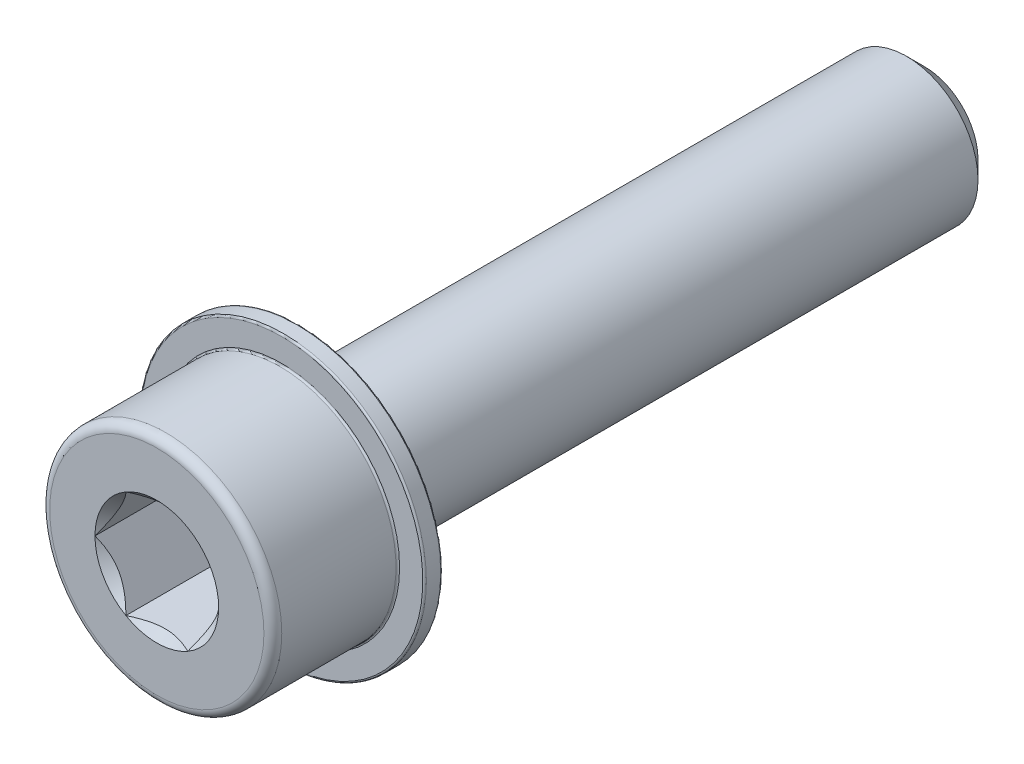
ISO-10303-21;
HEADER;
FILE_DESCRIPTION(('STEP AP214'),'2;1');
FILE_NAME('part.step','',(''),(''),'','','');
FILE_SCHEMA(('AUTOMOTIVE_DESIGN { 1 0 10303 214 1 1 1 1 }'));
ENDSEC;
DATA;
#1=APPLICATION_CONTEXT('core data for automotive mechanical design processes');
#2=APPLICATION_PROTOCOL_DEFINITION('international standard','automotive_design',2000,#1);
#3=PRODUCT_CONTEXT('',#1,'mechanical');
#4=PRODUCT('Part','Part','',(#3));
#5=PRODUCT_RELATED_PRODUCT_CATEGORY('part','',(#4));
#6=PRODUCT_DEFINITION_FORMATION('','',#4);
#7=PRODUCT_DEFINITION_CONTEXT('part definition',#1,'design');
#8=PRODUCT_DEFINITION('design','',#6,#7);
#9=PRODUCT_DEFINITION_SHAPE('','',#8);
#10=(LENGTH_UNIT() NAMED_UNIT(*) SI_UNIT(.MILLI.,.METRE.));
#11=(NAMED_UNIT(*) PLANE_ANGLE_UNIT() SI_UNIT($,.RADIAN.));
#12=(NAMED_UNIT(*) SI_UNIT($,.STERADIAN.) SOLID_ANGLE_UNIT());
#13=UNCERTAINTY_MEASURE_WITH_UNIT(LENGTH_MEASURE(1.E-05),#10,'distance_accuracy_value','');
#14=(GEOMETRIC_REPRESENTATION_CONTEXT(3) GLOBAL_UNCERTAINTY_ASSIGNED_CONTEXT((#13)) GLOBAL_UNIT_ASSIGNED_CONTEXT((#10,
#11,#12)) REPRESENTATION_CONTEXT('',''));
#15=CARTESIAN_POINT('',(0.,0.,0.));
#16=DIRECTION('',(0.,0.,1.));
#17=DIRECTION('',(1.,0.,0.));
#18=AXIS2_PLACEMENT_3D('',#15,#16,#17);
#19=CARTESIAN_POINT('',(0.,0.,43.));
#20=DIRECTION('',(0.,0.,-1.));
#21=DIRECTION('',(-1.,0.,0.));
#22=AXIS2_PLACEMENT_3D('',#19,#20,#21);
#23=CYLINDRICAL_SURFACE('',#22,6.5);
#24=CARTESIAN_POINT('',(0.,0.,36.1));
#25=DIRECTION('',(0.,0.,-1.));
#26=DIRECTION('',(-1.,0.,0.));
#27=AXIS2_PLACEMENT_3D('',#24,#25,#26);
#28=CIRCLE('',#27,6.5);
#29=CARTESIAN_POINT('',(-6.5,0.,36.1));
#30=VERTEX_POINT('',#29);
#31=EDGE_CURVE('E11',#30,#30,#28,.F.);
#32=ORIENTED_EDGE('',*,*,#31,.T.);
#33=EDGE_LOOP('',(#32));
#34=FACE_BOUND('',#33,.T.);
#35=CARTESIAN_POINT('',(0.,0.,42.5));
#36=DIRECTION('',(0.,0.,1.));
#37=DIRECTION('',(1.,0.,0.));
#38=AXIS2_PLACEMENT_3D('',#35,#36,#37);
#39=CIRCLE('',#38,6.5);
#40=CARTESIAN_POINT('',(6.5,0.,42.5));
#41=VERTEX_POINT('',#40);
#42=EDGE_CURVE('E275',#41,#41,#39,.F.);
#43=ORIENTED_EDGE('',*,*,#42,.T.);
#44=EDGE_LOOP('',(#43));
#45=FACE_BOUND('',#44,.T.);
#46=ADVANCED_FACE('F41',(#34,#45),#23,.T.);
#47=CARTESIAN_POINT('',(0.,0.,43.));
#48=DIRECTION('',(0.,0.,1.));
#49=DIRECTION('',(1.,0.,0.));
#50=AXIS2_PLACEMENT_3D('',#47,#48,#49);
#51=PLANE('',#50);
#52=CARTESIAN_POINT('',(0.,0.,43.));
#53=DIRECTION('',(0.,0.,1.));
#54=DIRECTION('',(1.,0.,0.));
#55=AXIS2_PLACEMENT_3D('',#52,#53,#54);
#56=CIRCLE('',#55,6.);
#57=CARTESIAN_POINT('',(6.,0.,43.));
#58=VERTEX_POINT('',#57);
#59=EDGE_CURVE('E117',#58,#58,#56,.T.);
#60=ORIENTED_EDGE('',*,*,#59,.T.);
#61=EDGE_LOOP('',(#60));
#62=FACE_BOUND('',#61,.T.);
#63=CARTESIAN_POINT('',(0.,0.,43.));
#64=DIRECTION('',(0.,0.,1.));
#65=DIRECTION('',(1.,0.,0.));
#66=AXIS2_PLACEMENT_3D('',#63,#64,#65);
#67=CIRCLE('',#66,3.46410161513776);
#68=CARTESIAN_POINT('',(3.46410161513776,0.,43.));
#69=VERTEX_POINT('',#68);
#70=CARTESIAN_POINT('',(1.73205080756888,3.,43.));
#71=VERTEX_POINT('',#70);
#72=EDGE_CURVE('E96',#69,#71,#67,.T.);
#73=ORIENTED_EDGE('',*,*,#72,.F.);
#74=CARTESIAN_POINT('',(1.73205080756888,-3.,43.));
#75=VERTEX_POINT('',#74);
#76=EDGE_CURVE('E56',#75,#69,#67,.T.);
#77=ORIENTED_EDGE('',*,*,#76,.F.);
#78=CARTESIAN_POINT('',(-1.73205080756888,-3.,43.));
#79=VERTEX_POINT('',#78);
#80=EDGE_CURVE('E360',#79,#75,#67,.T.);
#81=ORIENTED_EDGE('',*,*,#80,.F.);
#82=CARTESIAN_POINT('',(-3.46410161513776,0.,43.));
#83=VERTEX_POINT('',#82);
#84=EDGE_CURVE('E63',#83,#79,#67,.T.);
#85=ORIENTED_EDGE('',*,*,#84,.F.);
#86=CARTESIAN_POINT('',(-1.73205080756888,3.,43.));
#87=VERTEX_POINT('',#86);
#88=EDGE_CURVE('E141',#87,#83,#67,.T.);
#89=ORIENTED_EDGE('',*,*,#88,.F.);
#90=EDGE_CURVE('E106',#71,#87,#67,.T.);
#91=ORIENTED_EDGE('',*,*,#90,.F.);
#92=EDGE_LOOP('',(#73,#77,#81,#85,#89,#91));
#93=FACE_BOUND('',#92,.T.);
#94=ADVANCED_FACE('F140',(#62,#93),#51,.T.);
#95=CARTESIAN_POINT('',(0.,0.,43.));
#96=DIRECTION('',(0.,0.,1.));
#97=DIRECTION('',(1.,0.,0.));
#98=AXIS2_PLACEMENT_3D('',#95,#96,#97);
#99=CONICAL_SURFACE('',#98,3.46410161513776,0.785398163397449);
#100=ORIENTED_EDGE('',*,*,#90,.T.);
#101=CARTESIAN_POINT('',(-3.40188153141397,3.,44.071623018675));
#102=CARTESIAN_POINT('',(-3.31880839496224,3.,44.0093307707653));
#103=CARTESIAN_POINT('',(-3.23526432463499,3.,43.9476562262713));
#104=CARTESIAN_POINT('',(-3.06705083944725,3.,43.825817186681));
#105=CARTESIAN_POINT('',(-2.98238114192822,3.,43.7656530822642));
#106=CARTESIAN_POINT('',(-2.81111390830011,3.,43.6466823260063));
#107=CARTESIAN_POINT('',(-2.72450651479473,3.,43.5878898159252));
#108=CARTESIAN_POINT('',(-2.54981284655259,3.,43.4725516902232));
#109=CARTESIAN_POINT('',(-2.46172667795769,3.,43.4160059143113));
#110=CARTESIAN_POINT('',(-2.27892768432208,3.,43.3026064434241));
#111=CARTESIAN_POINT('',(-2.18411772294209,3.,43.2459085325007));
#112=CARTESIAN_POINT('',(-1.99231796342786,3.,43.1363338489189));
#113=CARTESIAN_POINT('',(-1.89532845598628,3.,43.0834565706102));
#114=CARTESIAN_POINT('',(-1.69915024178689,3.,42.9826433846406));
#115=CARTESIAN_POINT('',(-1.59996871640864,3.,42.9346936118117));
#116=CARTESIAN_POINT('',(-1.39893527870467,3.,42.8448170133997));
#117=CARTESIAN_POINT('',(-1.29708458210817,3.,42.8028875002659));
#118=CARTESIAN_POINT('',(-1.0982186531427,3.,42.7293601977538));
#119=CARTESIAN_POINT('',(-1.00140329048654,3.,42.6972274830937));
#120=CARTESIAN_POINT('',(-0.805487586800682,3.,42.6407367466802));
#121=CARTESIAN_POINT('',(-0.706387084473372,3.,42.6163792755582));
#122=CARTESIAN_POINT('',(-0.508116211624924,3.,42.5771014895869));
#123=CARTESIAN_POINT('',(-0.408977763183683,3.,42.5620226377466));
#124=CARTESIAN_POINT('',(-0.209698791301063,3.,42.5415865192691));
#125=CARTESIAN_POINT('',(-0.109558431989065,3.,42.5362276857281));
#126=CARTESIAN_POINT('',(0.0873520516843396,3.,42.535609235846));
#127=CARTESIAN_POINT('',(0.184121252918255,3.,42.5400131533177));
#128=CARTESIAN_POINT('',(0.376804854524577,3.,42.557946416793));
#129=CARTESIAN_POINT('',(0.472719169351944,3.,42.5714766658715));
#130=CARTESIAN_POINT('',(0.66461966332242,3.,42.6071635369876));
#131=CARTESIAN_POINT('',(0.760578448954834,3.,42.6294651712297));
#132=CARTESIAN_POINT('',(0.950411386335509,3.,42.6815211461887));
#133=CARTESIAN_POINT('',(1.04428572934496,3.,42.7112748000321));
#134=CARTESIAN_POINT('',(1.23968230612517,3.,42.7805237867733));
#135=CARTESIAN_POINT('',(1.34095401081408,3.,42.8207192131534));
#136=CARTESIAN_POINT('',(1.54084264319093,3.,42.9072590407946));
#137=CARTESIAN_POINT('',(1.63945865301323,3.,42.9536055360041));
#138=CARTESIAN_POINT('',(1.8345457021536,3.,43.0513511324151));
#139=CARTESIAN_POINT('',(1.93100848905254,3.,43.1027665721575));
#140=CARTESIAN_POINT('',(2.12170828880386,3.,43.2095076183011));
#141=CARTESIAN_POINT('',(2.21594570238895,3.,43.2648325134343));
#142=CARTESIAN_POINT('',(2.39783630702514,3.,43.3757799204079));
#143=CARTESIAN_POINT('',(2.48558325753569,3.,43.4312495308021));
#144=CARTESIAN_POINT('',(2.65957133871347,3.,43.54450927189));
#145=CARTESIAN_POINT('',(2.74581235420107,3.,43.6022995789736));
#146=CARTESIAN_POINT('',(2.91628413803161,3.,43.7193054641893));
#147=CARTESIAN_POINT('',(3.00052556721127,3.,43.7785055655618));
#148=CARTESIAN_POINT('',(3.16785911169908,3.,43.8984622960702));
#149=CARTESIAN_POINT('',(3.25095153629611,3.,43.9592184932626));
#150=CARTESIAN_POINT('',(3.33356317170769,3.,44.0206105740407));
#151=B_SPLINE_CURVE_WITH_KNOTS('',3,(#101,#102,#103,#104,#105,#106,#107,#108,#109,#110,#111,
#112,#113,#114,#115,#116,#117,#118,#119,#120,#121,#122,#123,#124,#125,#126,#127,#128,#129,#130,
#131,#132,#133,#134,#135,#136,#137,#138,#139,#140,#141,#142,#143,#144,#145,#146,#147,#148,#149,
#150),.UNSPECIFIED.,.F.,.F.,(4,2,2,2,2,2,2,2,2,2,2,2,2,2,2,2,2,2,2,2,2,2,2,2,4),(0.,
0.311507889644127,0.623095538398646,0.937099065704866,1.25108015037407,1.58241857439007,
1.91371306604159,2.24404824101607,2.57423548692227,2.87999017792551,3.18576651722764,
3.486161620239,3.78650829411698,4.07666515932723,4.36685074054528,4.6620503227987,
4.95722270569223,5.28383771583299,5.61056419890146,5.93838056110907,6.266137434759,
6.57752286720456,6.8889320121875,7.19780024979462,7.50658366111557),.UNSPECIFIED.);
#152=EDGE_CURVE('E111',#71,#87,#151,.F.);
#153=ORIENTED_EDGE('',*,*,#152,.F.);
#154=EDGE_LOOP('',(#100,#153));
#155=FACE_BOUND('',#154,.T.);
#156=ADVANCED_FACE('F112',(#155),#99,.F.);
#157=ORIENTED_EDGE('',*,*,#88,.T.);
#158=CARTESIAN_POINT('',(-1.73193533751504,3.0002,43.0001154758272));
#159=CARTESIAN_POINT('',(-1.79147372663452,2.89707648504425,42.9406283183218));
#160=CARTESIAN_POINT('',(-1.85200767512883,2.79222861066935,42.8846349794655));
#161=CARTESIAN_POINT('',(-1.97544301635334,2.5784323282189,42.7821125963789));
#162=CARTESIAN_POINT('',(-2.03835614749388,2.46946358862024,42.7356405937413));
#163=CARTESIAN_POINT('',(-2.16521745390422,2.24973336040297,42.6560331885163));
#164=CARTESIAN_POINT('',(-2.22913332270057,2.13902782823778,42.6226977006427));
#165=CARTESIAN_POINT('',(-2.35837216363117,1.91517958943467,42.5713375439793));
#166=CARTESIAN_POINT('',(-2.42369118784644,1.802043720793,42.5532745375356));
#167=CARTESIAN_POINT('',(-2.53626564359199,1.60705904380729,42.5369769084505));
#168=CARTESIAN_POINT('',(-2.58337569224233,1.52546204599786,42.5345643671738));
#169=CARTESIAN_POINT('',(-2.67751916315866,1.36240077116991,42.5386294346571));
#170=CARTESIAN_POINT('',(-2.7245525527757,1.28093655070101,42.5451101600283));
#171=CARTESIAN_POINT('',(-2.81817374583238,1.11877988766163,42.5665917225152));
#172=CARTESIAN_POINT('',(-2.86476099147974,1.03808841121569,42.5816020899673));
#173=CARTESIAN_POINT('',(-2.95713536549225,0.878091302108662,42.619323646066));
#174=CARTESIAN_POINT('',(-3.00292255491614,0.798785563690701,42.6420342443228));
#175=CARTESIAN_POINT('',(-3.0842086834051,0.657993859197244,42.6887606848539));
#176=CARTESIAN_POINT('',(-3.11988753362891,0.596196277853972,42.7115483276808));
#177=CARTESIAN_POINT('',(-3.19060468282508,0.473710582479779,42.7607962860574));
#178=CARTESIAN_POINT('',(-3.2256429622163,0.413022502364396,42.7872567136662));
#179=CARTESIAN_POINT('',(-3.29496858432307,0.292947002609138,42.8432569943914));
#180=CARTESIAN_POINT('',(-3.3292578988429,0.233556167704084,42.8727871644784));
#181=CARTESIAN_POINT('',(-3.39720147685868,0.115874438532734,42.9345390915755));
#182=CARTESIAN_POINT('',(-3.43085611477446,0.0575828957522678,42.9667591966594));
#183=CARTESIAN_POINT('',(-3.46421708519159,-0.000199999999998803,43.0001154758271));
#184=B_SPLINE_CURVE_WITH_KNOTS('',3,(#158,#159,#160,#161,#162,#163,#164,#165,#166,#167,#168,
#169,#170,#171,#172,#173,#174,#175,#176,#177,#178,#179,#180,#181,#182,#183),.UNSPECIFIED.,.F.,
.F.,(4,2,2,2,2,2,2,2,2,2,2,2,4),(0.,0.399603557139307,0.801535286397852,1.19708369162344,
1.59163620080174,1.87398941755845,2.15644160919094,2.43921001247426,2.72195674032139,
2.94657516661927,3.17120044767275,3.3951375283781,3.61893808380739),.UNSPECIFIED.);
#185=EDGE_CURVE('E105',#87,#83,#184,.T.);
#186=ORIENTED_EDGE('',*,*,#185,.F.);
#187=EDGE_LOOP('',(#157,#186));
#188=FACE_BOUND('',#187,.T.);
#189=ADVANCED_FACE('F371',(#188),#99,.F.);
#190=ORIENTED_EDGE('',*,*,#84,.T.);
#191=CARTESIAN_POINT('',(-3.46421708519159,0.000199999999998564,43.0001154758271));
#192=CARTESIAN_POINT('',(-3.40467869607211,-0.102923514955748,42.9406283183218));
#193=CARTESIAN_POINT('',(-3.3441447475778,-0.20777138933065,42.8846349794655));
#194=CARTESIAN_POINT('',(-3.22070940635329,-0.421567671781096,42.7821125963789));
#195=CARTESIAN_POINT('',(-3.15779627521275,-0.530536411379761,42.7356405937413));
#196=CARTESIAN_POINT('',(-3.03093496880241,-0.750266639597031,42.6560331885163));
#197=CARTESIAN_POINT('',(-2.96701910000606,-0.860972171762214,42.6226977006427));
#198=CARTESIAN_POINT('',(-2.83778025907546,-1.08482041056533,42.5713375439793));
#199=CARTESIAN_POINT('',(-2.77246123486019,-1.197956279207,42.5532745375356));
#200=CARTESIAN_POINT('',(-2.65988677911464,-1.3929409561927,42.5369769084505));
#201=CARTESIAN_POINT('',(-2.6127767304643,-1.47453795400214,42.5345643671738));
#202=CARTESIAN_POINT('',(-2.51863325954798,-1.63759922883009,42.5386294346571));
#203=CARTESIAN_POINT('',(-2.47159986993094,-1.71906344929899,42.5451101600283));
#204=CARTESIAN_POINT('',(-2.37797867687426,-1.88122011233837,42.5665917225152));
#205=CARTESIAN_POINT('',(-2.33139143122689,-1.9619115887843,42.5816020899673));
#206=CARTESIAN_POINT('',(-2.23901705721438,-2.12190869789134,42.619323646066));
#207=CARTESIAN_POINT('',(-2.19322986779049,-2.2012144363093,42.6420342443228));
#208=CARTESIAN_POINT('',(-2.11194373930153,-2.34200614080275,42.6887606848539));
#209=CARTESIAN_POINT('',(-2.07626488907772,-2.40380372214602,42.7115483276808));
#210=CARTESIAN_POINT('',(-2.00554773988155,-2.52628941752022,42.7607962860574));
#211=CARTESIAN_POINT('',(-1.97050946049033,-2.5869774976356,42.7872567136662));
#212=CARTESIAN_POINT('',(-1.90118383838355,-2.70705299739086,42.8432569943914));
#213=CARTESIAN_POINT('',(-1.86689452386372,-2.76644383229592,42.8727871644784));
#214=CARTESIAN_POINT('',(-1.79895094584794,-2.88412556146727,42.9345390915755));
#215=CARTESIAN_POINT('',(-1.76529630793216,-2.94241710424774,42.9667591966594));
#216=CARTESIAN_POINT('',(-1.73193533751504,-3.0002,43.0001154758272));
#217=B_SPLINE_CURVE_WITH_KNOTS('',3,(#191,#192,#193,#194,#195,#196,#197,#198,#199,#200,#201,
#202,#203,#204,#205,#206,#207,#208,#209,#210,#211,#212,#213,#214,#215,#216),.UNSPECIFIED.,.F.,
.F.,(4,2,2,2,2,2,2,2,2,2,2,2,4),(0.,0.399603557139304,0.801535286397844,1.19708369162343,
1.59163620080173,1.87398941755844,2.15644160919093,2.43921001247425,2.72195674032138,
2.94657516661926,3.17120044767274,3.3951375283781,3.61893808380739),.UNSPECIFIED.);
#218=EDGE_CURVE('E154',#83,#79,#217,.T.);
#219=ORIENTED_EDGE('',*,*,#218,.F.);
#220=EDGE_LOOP('',(#190,#219));
#221=FACE_BOUND('',#220,.T.);
#222=ADVANCED_FACE('F373',(#221),#99,.F.);
#223=ORIENTED_EDGE('',*,*,#80,.T.);
#224=CARTESIAN_POINT('',(-3.40188153141397,-3.,44.071623018675));
#225=CARTESIAN_POINT('',(-3.31880839496224,-3.,44.0093307707653));
#226=CARTESIAN_POINT('',(-3.23526432463498,-3.,43.9476562262713));
#227=CARTESIAN_POINT('',(-3.06705083944725,-3.,43.825817186681));
#228=CARTESIAN_POINT('',(-2.98238114192822,-3.,43.7656530822642));
#229=CARTESIAN_POINT('',(-2.81111390830011,-3.,43.6466823260063));
#230=CARTESIAN_POINT('',(-2.72450651479473,-3.,43.5878898159252));
#231=CARTESIAN_POINT('',(-2.54981284655259,-3.,43.4725516902232));
#232=CARTESIAN_POINT('',(-2.46172667795768,-3.,43.4160059143113));
#233=CARTESIAN_POINT('',(-2.27892768432207,-3.,43.3026064434241));
#234=CARTESIAN_POINT('',(-2.18411772294209,-3.,43.2459085325007));
#235=CARTESIAN_POINT('',(-1.99231796342786,-3.,43.1363338489189));
#236=CARTESIAN_POINT('',(-1.89532845598629,-3.,43.0834565706102));
#237=CARTESIAN_POINT('',(-1.69915024178689,-3.,42.9826433846406));
#238=CARTESIAN_POINT('',(-1.59996871640864,-3.,42.9346936118117));
#239=CARTESIAN_POINT('',(-1.39893527870467,-3.,42.8448170133997));
#240=CARTESIAN_POINT('',(-1.29708458210817,-3.,42.8028875002659));
#241=CARTESIAN_POINT('',(-1.0982186531427,-3.,42.7293601977538));
#242=CARTESIAN_POINT('',(-1.00140329048654,-3.,42.6972274830937));
#243=CARTESIAN_POINT('',(-0.80548758680068,-3.,42.6407367466802));
#244=CARTESIAN_POINT('',(-0.70638708447337,-3.,42.6163792755582));
#245=CARTESIAN_POINT('',(-0.508116211624922,-3.,42.5771014895869));
#246=CARTESIAN_POINT('',(-0.408977763183681,-3.,42.5620226377466));
#247=CARTESIAN_POINT('',(-0.20969879130106,-3.,42.5415865192691));
#248=CARTESIAN_POINT('',(-0.109558431989063,-3.,42.5362276857281));
#249=CARTESIAN_POINT('',(0.0873520516843408,-3.,42.535609235846));
#250=CARTESIAN_POINT('',(0.184121252918256,-3.,42.5400131533177));
#251=CARTESIAN_POINT('',(0.376804854524577,-3.,42.557946416793));
#252=CARTESIAN_POINT('',(0.472719169351944,-3.,42.5714766658715));
#253=CARTESIAN_POINT('',(0.664619663322421,-3.,42.6071635369876));
#254=CARTESIAN_POINT('',(0.760578448954834,-3.,42.6294651712297));
#255=CARTESIAN_POINT('',(0.95041138633551,-3.,42.6815211461887));
#256=CARTESIAN_POINT('',(1.04428572934496,-3.,42.7112748000321));
#257=CARTESIAN_POINT('',(1.23968230612517,-3.,42.7805237867733));
#258=CARTESIAN_POINT('',(1.34095401081408,-3.,42.8207192131534));
#259=CARTESIAN_POINT('',(1.54084264319093,-3.,42.9072590407946));
#260=CARTESIAN_POINT('',(1.63945865301324,-3.,42.9536055360041));
#261=CARTESIAN_POINT('',(1.8345457021536,-3.,43.0513511324151));
#262=CARTESIAN_POINT('',(1.93100848905254,-3.,43.1027665721575));
#263=CARTESIAN_POINT('',(2.12170828880386,-3.,43.2095076183011));
#264=CARTESIAN_POINT('',(2.21594570238895,-3.,43.2648325134343));
#265=CARTESIAN_POINT('',(2.39783630702514,-3.,43.3757799204079));
#266=CARTESIAN_POINT('',(2.48558325753569,-3.,43.4312495308021));
#267=CARTESIAN_POINT('',(2.65957133871347,-3.,43.54450927189));
#268=CARTESIAN_POINT('',(2.74581235420107,-3.,43.6022995789736));
#269=CARTESIAN_POINT('',(2.91628413803161,-3.,43.7193054641893));
#270=CARTESIAN_POINT('',(3.00052556721127,-3.,43.7785055655619));
#271=CARTESIAN_POINT('',(3.16785911169908,-3.,43.8984622960703));
#272=CARTESIAN_POINT('',(3.25095153629612,-3.,43.9592184932626));
#273=CARTESIAN_POINT('',(3.3335631717077,-3.,44.0206105740407));
#274=B_SPLINE_CURVE_WITH_KNOTS('',3,(#224,#225,#226,#227,#228,#229,#230,#231,#232,#233,#234,
#235,#236,#237,#238,#239,#240,#241,#242,#243,#244,#245,#246,#247,#248,#249,#250,#251,#252,#253,
#254,#255,#256,#257,#258,#259,#260,#261,#262,#263,#264,#265,#266,#267,#268,#269,#270,#271,#272,
#273),.UNSPECIFIED.,.F.,.F.,(4,2,2,2,2,2,2,2,2,2,2,2,2,2,2,2,2,2,2,2,2,2,2,2,4),(0.,
0.311507889644125,0.623095538398644,0.937099065704865,1.25108015037407,1.58241857439006,
1.91371306604159,2.24404824101607,2.57423548692227,2.87999017792551,3.18576651722764,
3.486161620239,3.78650829411698,4.07666515932722,4.36685074054528,4.6620503227987,
4.95722270569223,5.28383771583299,5.61056419890146,5.93838056110907,6.266137434759,
6.57752286720456,6.8889320121875,7.19780024979462,7.50658366111557),.UNSPECIFIED.);
#275=EDGE_CURVE('E184',#79,#75,#274,.T.);
#276=ORIENTED_EDGE('',*,*,#275,.F.);
#277=EDGE_LOOP('',(#223,#276));
#278=FACE_BOUND('',#277,.T.);
#279=ADVANCED_FACE('F361',(#278),#99,.F.);
#280=ORIENTED_EDGE('',*,*,#76,.T.);
#281=CARTESIAN_POINT('',(1.73193533751504,-3.0002,43.0001154758272));
#282=CARTESIAN_POINT('',(1.79147372663452,-2.89707648504425,42.9406283183218));
#283=CARTESIAN_POINT('',(1.85200767512883,-2.79222861066935,42.8846349794655));
#284=CARTESIAN_POINT('',(1.97544301635334,-2.57843232821891,42.7821125963789));
#285=CARTESIAN_POINT('',(2.03835614749388,-2.46946358862024,42.7356405937413));
#286=CARTESIAN_POINT('',(2.16521745390422,-2.24973336040297,42.6560331885163));
#287=CARTESIAN_POINT('',(2.22913332270057,-2.13902782823779,42.6226977006427));
#288=CARTESIAN_POINT('',(2.35837216363117,-1.91517958943468,42.5713375439793));
#289=CARTESIAN_POINT('',(2.42369118784644,-1.80204372079301,42.5532745375356));
#290=CARTESIAN_POINT('',(2.53626564359199,-1.6070590438073,42.5369769084505));
#291=CARTESIAN_POINT('',(2.58337569224233,-1.52546204599787,42.5345643671738));
#292=CARTESIAN_POINT('',(2.67751916315865,-1.36240077116991,42.5386294346571));
#293=CARTESIAN_POINT('',(2.7245525527757,-1.28093655070101,42.5451101600283));
#294=CARTESIAN_POINT('',(2.81817374583237,-1.11877988766163,42.5665917225152));
#295=CARTESIAN_POINT('',(2.86476099147974,-1.0380884112157,42.5816020899673));
#296=CARTESIAN_POINT('',(2.95713536549225,-0.878091302108666,42.619323646066));
#297=CARTESIAN_POINT('',(3.00292255491614,-0.798785563690705,42.6420342443228));
#298=CARTESIAN_POINT('',(3.0842086834051,-0.657993859197248,42.6887606848539));
#299=CARTESIAN_POINT('',(3.11988753362891,-0.596196277853976,42.7115483276808));
#300=CARTESIAN_POINT('',(3.19060468282508,-0.473710582479782,42.7607962860574));
#301=CARTESIAN_POINT('',(3.2256429622163,-0.413022502364398,42.7872567136662));
#302=CARTESIAN_POINT('',(3.29496858432308,-0.292947002609137,42.8432569943914));
#303=CARTESIAN_POINT('',(3.32925789884291,-0.233556167704082,42.8727871644784));
#304=CARTESIAN_POINT('',(3.39720147685869,-0.115874438532731,42.9345390915755));
#305=CARTESIAN_POINT('',(3.43085611477447,-0.0575828957522658,42.9667591966594));
#306=CARTESIAN_POINT('',(3.46421708519159,0.000200000000000719,43.0001154758272));
#307=B_SPLINE_CURVE_WITH_KNOTS('',3,(#281,#282,#283,#284,#285,#286,#287,#288,#289,#290,#291,
#292,#293,#294,#295,#296,#297,#298,#299,#300,#301,#302,#303,#304,#305,#306),.UNSPECIFIED.,.F.,
.F.,(4,2,2,2,2,2,2,2,2,2,2,2,4),(0.,0.399603557139305,0.801535286397845,1.19708369162343,
1.59163620080173,1.87398941755845,2.15644160919093,2.43921001247425,2.72195674032138,
2.94657516661927,3.17120044767274,3.3951375283781,3.61893808380739),.UNSPECIFIED.);
#308=EDGE_CURVE('E129',#75,#69,#307,.T.);
#309=ORIENTED_EDGE('',*,*,#308,.F.);
#310=EDGE_LOOP('',(#280,#309));
#311=FACE_BOUND('',#310,.T.);
#312=ADVANCED_FACE('F169',(#311),#99,.F.);
#313=ORIENTED_EDGE('',*,*,#72,.T.);
#314=CARTESIAN_POINT('',(3.46421708519159,-0.000199999999999999,43.0001154758272));
#315=CARTESIAN_POINT('',(3.40467869607211,0.102923514955748,42.9406283183218));
#316=CARTESIAN_POINT('',(3.3441447475778,0.20777138933065,42.8846349794655));
#317=CARTESIAN_POINT('',(3.2207094063533,0.421567671781094,42.7821125963789));
#318=CARTESIAN_POINT('',(3.15779627521275,0.530536411379758,42.7356405937413));
#319=CARTESIAN_POINT('',(3.03093496880242,0.750266639597028,42.6560331885163));
#320=CARTESIAN_POINT('',(2.96701910000607,0.860972171762212,42.6226977006427));
#321=CARTESIAN_POINT('',(2.83778025907547,1.08482041056533,42.5713375439793));
#322=CARTESIAN_POINT('',(2.7724612348602,1.197956279207,42.5532745375356));
#323=CARTESIAN_POINT('',(2.65988677911464,1.3929409561927,42.5369769084505));
#324=CARTESIAN_POINT('',(2.6127767304643,1.47453795400214,42.5345643671738));
#325=CARTESIAN_POINT('',(2.51863325954798,1.63759922883009,42.5386294346571));
#326=CARTESIAN_POINT('',(2.47159986993094,1.71906344929899,42.5451101600283));
#327=CARTESIAN_POINT('',(2.37797867687426,1.88122011233837,42.5665917225152));
#328=CARTESIAN_POINT('',(2.33139143122689,1.9619115887843,42.5816020899673));
#329=CARTESIAN_POINT('',(2.23901705721438,2.12190869789134,42.619323646066));
#330=CARTESIAN_POINT('',(2.19322986779049,2.2012144363093,42.6420342443228));
#331=CARTESIAN_POINT('',(2.11194373930153,2.34200614080275,42.6887606848539));
#332=CARTESIAN_POINT('',(2.07626488907772,2.40380372214603,42.7115483276808));
#333=CARTESIAN_POINT('',(2.00554773988155,2.52628941752022,42.7607962860574));
#334=CARTESIAN_POINT('',(1.97050946049034,2.5869774976356,42.7872567136662));
#335=CARTESIAN_POINT('',(1.90118383838356,2.70705299739086,42.8432569943914));
#336=CARTESIAN_POINT('',(1.86689452386373,2.76644383229592,42.8727871644784));
#337=CARTESIAN_POINT('',(1.79895094584795,2.88412556146727,42.9345390915755));
#338=CARTESIAN_POINT('',(1.76529630793217,2.94241710424774,42.9667591966594));
#339=CARTESIAN_POINT('',(1.73193533751504,3.0002,43.0001154758272));
#340=B_SPLINE_CURVE_WITH_KNOTS('',3,(#314,#315,#316,#317,#318,#319,#320,#321,#322,#323,#324,
#325,#326,#327,#328,#329,#330,#331,#332,#333,#334,#335,#336,#337,#338,#339),.UNSPECIFIED.,.F.,
.F.,(4,2,2,2,2,2,2,2,2,2,2,2,4),(0.,0.399603557139305,0.801535286397845,1.19708369162343,
1.59163620080173,1.87398941755844,2.15644160919093,2.43921001247425,2.72195674032138,
2.94657516661927,3.17120044767274,3.3951375283781,3.61893808380739),.UNSPECIFIED.);
#341=EDGE_CURVE('E100',#69,#71,#340,.T.);
#342=ORIENTED_EDGE('',*,*,#341,.F.);
#343=EDGE_LOOP('',(#313,#342));
#344=FACE_BOUND('',#343,.T.);
#345=ADVANCED_FACE('F98',(#344),#99,.F.);
#346=CARTESIAN_POINT('',(0.,0.,37.));
#347=DIRECTION('',(0.,0.,1.));
#348=DIRECTION('',(1.,0.,0.));
#349=AXIS2_PLACEMENT_3D('',#346,#347,#348);
#350=PLANE('',#349);
#351=DIRECTION('',(-0.5,0.866025403784439,0.));
#352=VECTOR('',#351,1.);
#353=CARTESIAN_POINT('',(3.46410161513776,0.,37.));
#354=LINE('',#353,#352);
#355=CARTESIAN_POINT('',(3.46410161513776,0.,37.));
#356=VERTEX_POINT('',#355);
#357=CARTESIAN_POINT('',(1.73205080756888,3.,37.));
#358=VERTEX_POINT('',#357);
#359=EDGE_CURVE('E128',#356,#358,#354,.T.);
#360=ORIENTED_EDGE('',*,*,#359,.T.);
#361=DIRECTION('',(-1.,0.,0.));
#362=VECTOR('',#361,1.);
#363=CARTESIAN_POINT('',(1.73205080756888,3.,37.));
#364=LINE('',#363,#362);
#365=CARTESIAN_POINT('',(-1.73205080756888,3.,37.));
#366=VERTEX_POINT('',#365);
#367=EDGE_CURVE('E133',#358,#366,#364,.T.);
#368=ORIENTED_EDGE('',*,*,#367,.T.);
#369=DIRECTION('',(-0.5,-0.866025403784439,0.));
#370=VECTOR('',#369,1.);
#371=CARTESIAN_POINT('',(-1.73205080756888,3.,37.));
#372=LINE('',#371,#370);
#373=CARTESIAN_POINT('',(-3.46410161513775,0.,37.));
#374=VERTEX_POINT('',#373);
#375=EDGE_CURVE('E347',#366,#374,#372,.T.);
#376=ORIENTED_EDGE('',*,*,#375,.T.);
#377=DIRECTION('',(0.5,-0.866025403784439,0.));
#378=VECTOR('',#377,1.);
#379=CARTESIAN_POINT('',(-3.46410161513775,0.,37.));
#380=LINE('',#379,#378);
#381=CARTESIAN_POINT('',(-1.73205080756887,-3.,37.));
#382=VERTEX_POINT('',#381);
#383=EDGE_CURVE('E343',#374,#382,#380,.T.);
#384=ORIENTED_EDGE('',*,*,#383,.T.);
#385=DIRECTION('',(1.,0.,0.));
#386=VECTOR('',#385,1.);
#387=CARTESIAN_POINT('',(-1.73205080756887,-3.,37.));
#388=LINE('',#387,#386);
#389=CARTESIAN_POINT('',(1.73205080756888,-3.,37.));
#390=VERTEX_POINT('',#389);
#391=EDGE_CURVE('E339',#382,#390,#388,.T.);
#392=ORIENTED_EDGE('',*,*,#391,.T.);
#393=DIRECTION('',(0.5,0.866025403784439,0.));
#394=VECTOR('',#393,1.);
#395=CARTESIAN_POINT('',(1.73205080756888,-3.,37.));
#396=LINE('',#395,#394);
#397=EDGE_CURVE('E137',#390,#356,#396,.T.);
#398=ORIENTED_EDGE('',*,*,#397,.T.);
#399=EDGE_LOOP('',(#360,#368,#376,#384,#392,#398));
#400=FACE_BOUND('',#399,.T.);
#401=ADVANCED_FACE('F168',(#400),#350,.T.);
#402=CARTESIAN_POINT('',(1.73205080756888,3.,37.));
#403=DIRECTION('',(0.,1.,0.));
#404=DIRECTION('',(-1.,0.,0.));
#405=AXIS2_PLACEMENT_3D('',#402,#403,#404);
#406=PLANE('',#405);
#407=DIRECTION('',(0.,0.,1.));
#408=VECTOR('',#407,1.);
#409=CARTESIAN_POINT('',(1.73205080756888,3.,37.));
#410=LINE('',#409,#408);
#411=EDGE_CURVE('E124',#358,#71,#410,.T.);
#412=ORIENTED_EDGE('',*,*,#411,.T.);
#413=ORIENTED_EDGE('',*,*,#152,.T.);
#414=DIRECTION('',(0.,0.,1.));
#415=VECTOR('',#414,1.);
#416=CARTESIAN_POINT('',(-1.73205080756888,3.,37.));
#417=LINE('',#416,#415);
#418=EDGE_CURVE('E136',#366,#87,#417,.T.);
#419=ORIENTED_EDGE('',*,*,#418,.F.);
#420=ORIENTED_EDGE('',*,*,#367,.F.);
#421=EDGE_LOOP('',(#412,#413,#419,#420));
#422=FACE_BOUND('',#421,.T.);
#423=ADVANCED_FACE('F131',(#422),#406,.F.);
#424=CARTESIAN_POINT('',(-1.73205080756888,3.,37.));
#425=DIRECTION('',(-0.866025403784439,0.5,0.));
#426=DIRECTION('',(-0.5,-0.866025403784439,0.));
#427=AXIS2_PLACEMENT_3D('',#424,#425,#426);
#428=PLANE('',#427);
#429=ORIENTED_EDGE('',*,*,#418,.T.);
#430=ORIENTED_EDGE('',*,*,#185,.T.);
#431=DIRECTION('',(0.,0.,1.));
#432=VECTOR('',#431,1.);
#433=CARTESIAN_POINT('',(-3.46410161513775,0.,37.));
#434=LINE('',#433,#432);
#435=EDGE_CURVE('E327',#374,#83,#434,.T.);
#436=ORIENTED_EDGE('',*,*,#435,.F.);
#437=ORIENTED_EDGE('',*,*,#375,.F.);
#438=EDGE_LOOP('',(#429,#430,#436,#437));
#439=FACE_BOUND('',#438,.T.);
#440=ADVANCED_FACE('F161',(#439),#428,.F.);
#441=CARTESIAN_POINT('',(-3.46410161513775,0.,37.));
#442=DIRECTION('',(-0.866025403784439,-0.5,0.));
#443=DIRECTION('',(0.5,-0.866025403784439,0.));
#444=AXIS2_PLACEMENT_3D('',#441,#442,#443);
#445=PLANE('',#444);
#446=ORIENTED_EDGE('',*,*,#435,.T.);
#447=ORIENTED_EDGE('',*,*,#218,.T.);
#448=DIRECTION('',(0.,0.,1.));
#449=VECTOR('',#448,1.);
#450=CARTESIAN_POINT('',(-1.73205080756887,-3.,37.));
#451=LINE('',#450,#449);
#452=EDGE_CURVE('E330',#382,#79,#451,.T.);
#453=ORIENTED_EDGE('',*,*,#452,.F.);
#454=ORIENTED_EDGE('',*,*,#383,.F.);
#455=EDGE_LOOP('',(#446,#447,#453,#454));
#456=FACE_BOUND('',#455,.T.);
#457=ADVANCED_FACE('F209',(#456),#445,.F.);
#458=CARTESIAN_POINT('',(-1.73205080756887,-3.,37.));
#459=DIRECTION('',(0.,-1.,0.));
#460=DIRECTION('',(1.,0.,0.));
#461=AXIS2_PLACEMENT_3D('',#458,#459,#460);
#462=PLANE('',#461);
#463=ORIENTED_EDGE('',*,*,#452,.T.);
#464=ORIENTED_EDGE('',*,*,#275,.T.);
#465=DIRECTION('',(0.,0.,1.));
#466=VECTOR('',#465,1.);
#467=CARTESIAN_POINT('',(1.73205080756888,-3.,37.));
#468=LINE('',#467,#466);
#469=EDGE_CURVE('E310',#390,#75,#468,.T.);
#470=ORIENTED_EDGE('',*,*,#469,.F.);
#471=ORIENTED_EDGE('',*,*,#391,.F.);
#472=EDGE_LOOP('',(#463,#464,#470,#471));
#473=FACE_BOUND('',#472,.T.);
#474=ADVANCED_FACE('F205',(#473),#462,.F.);
#475=CARTESIAN_POINT('',(1.73205080756888,-3.,37.));
#476=DIRECTION('',(0.866025403784439,-0.5,0.));
#477=DIRECTION('',(0.5,0.866025403784439,0.));
#478=AXIS2_PLACEMENT_3D('',#475,#476,#477);
#479=PLANE('',#478);
#480=ORIENTED_EDGE('',*,*,#469,.T.);
#481=ORIENTED_EDGE('',*,*,#308,.T.);
#482=DIRECTION('',(0.,0.,1.));
#483=VECTOR('',#482,1.);
#484=CARTESIAN_POINT('',(3.46410161513776,0.,37.));
#485=LINE('',#484,#483);
#486=EDGE_CURVE('E126',#356,#69,#485,.T.);
#487=ORIENTED_EDGE('',*,*,#486,.F.);
#488=ORIENTED_EDGE('',*,*,#397,.F.);
#489=EDGE_LOOP('',(#480,#481,#487,#488));
#490=FACE_BOUND('',#489,.T.);
#491=ADVANCED_FACE('F202',(#490),#479,.F.);
#492=CARTESIAN_POINT('',(3.46410161513776,0.,37.));
#493=DIRECTION('',(0.866025403784438,0.5,0.));
#494=DIRECTION('',(-0.5,0.866025403784439,0.));
#495=AXIS2_PLACEMENT_3D('',#492,#493,#494);
#496=PLANE('',#495);
#497=ORIENTED_EDGE('',*,*,#486,.T.);
#498=ORIENTED_EDGE('',*,*,#341,.T.);
#499=ORIENTED_EDGE('',*,*,#411,.F.);
#500=ORIENTED_EDGE('',*,*,#359,.F.);
#501=EDGE_LOOP('',(#497,#498,#499,#500));
#502=FACE_BOUND('',#501,.T.);
#503=ADVANCED_FACE('F122',(#502),#496,.F.);
#504=CARTESIAN_POINT('',(0.,0.,42.5));
#505=DIRECTION('',(0.,0.,1.));
#506=DIRECTION('',(1.,0.,0.));
#507=AXIS2_PLACEMENT_3D('',#504,#505,#506);
#508=TOROIDAL_SURFACE('',#507,6.,0.5);
#509=ORIENTED_EDGE('',*,*,#42,.F.);
#510=EDGE_LOOP('',(#509));
#511=FACE_BOUND('',#510,.T.);
#512=ORIENTED_EDGE('',*,*,#59,.F.);
#513=EDGE_LOOP('',(#512));
#514=FACE_BOUND('',#513,.T.);
#515=ADVANCED_FACE('F244',(#511,#514),#508,.T.);
#516=CARTESIAN_POINT('',(0.,0.,36.));
#517=DIRECTION('',(0.,0.,-1.));
#518=DIRECTION('',(-1.,0.,0.));
#519=AXIS2_PLACEMENT_3D('',#516,#517,#518);
#520=CYLINDRICAL_SURFACE('',#519,8.);
#521=CARTESIAN_POINT('',(0.,0.,35.1));
#522=DIRECTION('',(0.,0.,1.));
#523=DIRECTION('',(1.,0.,0.));
#524=AXIS2_PLACEMENT_3D('',#521,#522,#523);
#525=CIRCLE('',#524,8.);
#526=CARTESIAN_POINT('',(8.,0.,35.1));
#527=VERTEX_POINT('',#526);
#528=EDGE_CURVE('E266',#527,#527,#525,.T.);
#529=ORIENTED_EDGE('',*,*,#528,.T.);
#530=EDGE_LOOP('',(#529));
#531=FACE_BOUND('',#530,.T.);
#532=CARTESIAN_POINT('',(0.,0.,35.9));
#533=DIRECTION('',(0.,0.,-1.));
#534=DIRECTION('',(-1.,0.,0.));
#535=AXIS2_PLACEMENT_3D('',#532,#533,#534);
#536=CIRCLE('',#535,8.);
#537=CARTESIAN_POINT('',(-8.,0.,35.9));
#538=VERTEX_POINT('',#537);
#539=EDGE_CURVE('E263',#538,#538,#536,.T.);
#540=ORIENTED_EDGE('',*,*,#539,.T.);
#541=EDGE_LOOP('',(#540));
#542=FACE_BOUND('',#541,.T.);
#543=ADVANCED_FACE('F170',(#531,#542),#520,.T.);
#544=CARTESIAN_POINT('',(0.,0.,36.));
#545=DIRECTION('',(0.,0.,-1.));
#546=DIRECTION('',(-1.,0.,0.));
#547=AXIS2_PLACEMENT_3D('',#544,#545,#546);
#548=PLANE('',#547);
#549=CARTESIAN_POINT('',(0.,0.,36.));
#550=DIRECTION('',(0.,0.,-1.));
#551=DIRECTION('',(-1.,0.,0.));
#552=AXIS2_PLACEMENT_3D('',#549,#550,#551);
#553=CIRCLE('',#552,7.9);
#554=CARTESIAN_POINT('',(-7.9,0.,36.));
#555=VERTEX_POINT('',#554);
#556=EDGE_CURVE('E50',#555,#555,#553,.F.);
#557=ORIENTED_EDGE('',*,*,#556,.T.);
#558=EDGE_LOOP('',(#557));
#559=FACE_BOUND('',#558,.T.);
#560=CARTESIAN_POINT('',(0.,0.,36.));
#561=DIRECTION('',(0.,0.,-1.));
#562=DIRECTION('',(-1.,0.,0.));
#563=AXIS2_PLACEMENT_3D('',#560,#561,#562);
#564=CIRCLE('',#563,6.6);
#565=CARTESIAN_POINT('',(-6.6,0.,36.));
#566=VERTEX_POINT('',#565);
#567=EDGE_CURVE('E272',#566,#566,#564,.T.);
#568=ORIENTED_EDGE('',*,*,#567,.T.);
#569=EDGE_LOOP('',(#568));
#570=FACE_BOUND('',#569,.T.);
#571=ADVANCED_FACE('F235',(#559,#570),#548,.F.);
#572=CARTESIAN_POINT('',(0.,0.,0.));
#573=DIRECTION('',(0.,0.,1.));
#574=DIRECTION('',(1.,0.,0.));
#575=AXIS2_PLACEMENT_3D('',#572,#573,#574);
#576=PLANE('',#575);
#577=CARTESIAN_POINT('',(0.,0.,0.));
#578=DIRECTION('',(0.,0.,1.));
#579=DIRECTION('',(1.,0.,0.));
#580=AXIS2_PLACEMENT_3D('',#577,#578,#579);
#581=CIRCLE('',#580,3.);
#582=CARTESIAN_POINT('',(3.,0.,0.));
#583=VERTEX_POINT('',#582);
#584=EDGE_CURVE('E118',#583,#583,#581,.F.);
#585=ORIENTED_EDGE('',*,*,#584,.T.);
#586=EDGE_LOOP('',(#585));
#587=FACE_BOUND('',#586,.T.);
#588=ADVANCED_FACE('F231',(#587),#576,.F.);
#589=CARTESIAN_POINT('',(0.,0.,1.));
#590=DIRECTION('',(0.,0.,1.));
#591=DIRECTION('',(1.,0.,0.));
#592=AXIS2_PLACEMENT_3D('',#589,#590,#591);
#593=CONICAL_SURFACE('',#592,4.,0.78539816339745);
#594=ORIENTED_EDGE('',*,*,#584,.F.);
#595=EDGE_LOOP('',(#594));
#596=FACE_BOUND('',#595,.T.);
#597=CARTESIAN_POINT('',(0.,0.,1.));
#598=DIRECTION('',(0.,0.,1.));
#599=DIRECTION('',(1.,0.,0.));
#600=AXIS2_PLACEMENT_3D('',#597,#598,#599);
#601=CIRCLE('',#600,4.);
#602=CARTESIAN_POINT('',(4.,0.,1.));
#603=VERTEX_POINT('',#602);
#604=EDGE_CURVE('E304',#603,#603,#601,.T.);
#605=ORIENTED_EDGE('',*,*,#604,.F.);
#606=EDGE_LOOP('',(#605));
#607=FACE_BOUND('',#606,.T.);
#608=ADVANCED_FACE('F234',(#596,#607),#593,.T.);
#609=CARTESIAN_POINT('',(0.,0.,35.));
#610=DIRECTION('',(0.,0.,-1.));
#611=DIRECTION('',(-1.,0.,0.));
#612=AXIS2_PLACEMENT_3D('',#609,#610,#611);
#613=CYLINDRICAL_SURFACE('',#612,4.);
#614=ORIENTED_EDGE('',*,*,#604,.T.);
#615=EDGE_LOOP('',(#614));
#616=FACE_BOUND('',#615,.T.);
#617=CARTESIAN_POINT('',(0.,0.,35.));
#618=DIRECTION('',(0.,0.,1.));
#619=DIRECTION('',(1.,0.,0.));
#620=AXIS2_PLACEMENT_3D('',#617,#618,#619);
#621=CIRCLE('',#620,4.);
#622=CARTESIAN_POINT('',(4.,0.,35.));
#623=VERTEX_POINT('',#622);
#624=EDGE_CURVE('E301',#623,#623,#621,.T.);
#625=ORIENTED_EDGE('',*,*,#624,.F.);
#626=EDGE_LOOP('',(#625));
#627=FACE_BOUND('',#626,.T.);
#628=ADVANCED_FACE('F237',(#616,#627),#613,.T.);
#629=CARTESIAN_POINT('',(0.,0.,35.));
#630=DIRECTION('',(0.,0.,1.));
#631=DIRECTION('',(1.,0.,0.));
#632=AXIS2_PLACEMENT_3D('',#629,#630,#631);
#633=PLANE('',#632);
#634=CARTESIAN_POINT('',(0.,0.,35.));
#635=DIRECTION('',(0.,0.,1.));
#636=DIRECTION('',(1.,0.,0.));
#637=AXIS2_PLACEMENT_3D('',#634,#635,#636);
#638=CIRCLE('',#637,7.9);
#639=CARTESIAN_POINT('',(7.9,0.,35.));
#640=VERTEX_POINT('',#639);
#641=EDGE_CURVE('E267',#640,#640,#638,.F.);
#642=ORIENTED_EDGE('',*,*,#641,.T.);
#643=EDGE_LOOP('',(#642));
#644=FACE_BOUND('',#643,.T.);
#645=ORIENTED_EDGE('',*,*,#624,.T.);
#646=EDGE_LOOP('',(#645));
#647=FACE_BOUND('',#646,.T.);
#648=ADVANCED_FACE('F230',(#644,#647),#633,.F.);
#649=CARTESIAN_POINT('',(0.,0.,35.1));
#650=DIRECTION('',(0.,0.,1.));
#651=DIRECTION('',(1.,0.,0.));
#652=AXIS2_PLACEMENT_3D('',#649,#650,#651);
#653=TOROIDAL_SURFACE('',#652,7.9,0.1);
#654=ORIENTED_EDGE('',*,*,#528,.F.);
#655=EDGE_LOOP('',(#654));
#656=FACE_BOUND('',#655,.T.);
#657=ORIENTED_EDGE('',*,*,#641,.F.);
#658=EDGE_LOOP('',(#657));
#659=FACE_BOUND('',#658,.T.);
#660=ADVANCED_FACE('F248',(#656,#659),#653,.T.);
#661=CARTESIAN_POINT('',(0.,0.,35.9));
#662=DIRECTION('',(0.,0.,-1.));
#663=DIRECTION('',(-1.,0.,0.));
#664=AXIS2_PLACEMENT_3D('',#661,#662,#663);
#665=TOROIDAL_SURFACE('',#664,7.9,0.1);
#666=ORIENTED_EDGE('',*,*,#556,.F.);
#667=EDGE_LOOP('',(#666));
#668=FACE_BOUND('',#667,.T.);
#669=ORIENTED_EDGE('',*,*,#539,.F.);
#670=EDGE_LOOP('',(#669));
#671=FACE_BOUND('',#670,.T.);
#672=ADVANCED_FACE('F250',(#668,#671),#665,.T.);
#673=CARTESIAN_POINT('',(0.,0.,36.1));
#674=DIRECTION('',(0.,0.,-1.));
#675=DIRECTION('',(-1.,0.,0.));
#676=AXIS2_PLACEMENT_3D('',#673,#674,#675);
#677=TOROIDAL_SURFACE('',#676,6.6,0.1);
#678=ORIENTED_EDGE('',*,*,#31,.F.);
#679=EDGE_LOOP('',(#678));
#680=FACE_BOUND('',#679,.T.);
#681=ORIENTED_EDGE('',*,*,#567,.F.);
#682=EDGE_LOOP('',(#681));
#683=FACE_BOUND('',#682,.T.);
#684=ADVANCED_FACE('F43',(#680,#683),#677,.F.);
#685=CLOSED_SHELL('',(#46,#94,#156,#189,#222,#279,#312,#345,#401,#423,#440,#457,#474,#491,#503,
#515,#543,#571,#588,#608,#628,#648,#660,#672,#684));
#686=MANIFOLD_SOLID_BREP('B2',#685);
#687=ADVANCED_BREP_SHAPE_REPRESENTATION('',(#18,#686),#14);
#688=SHAPE_DEFINITION_REPRESENTATION(#9,#687);
ENDSEC;
END-ISO-10303-21;
